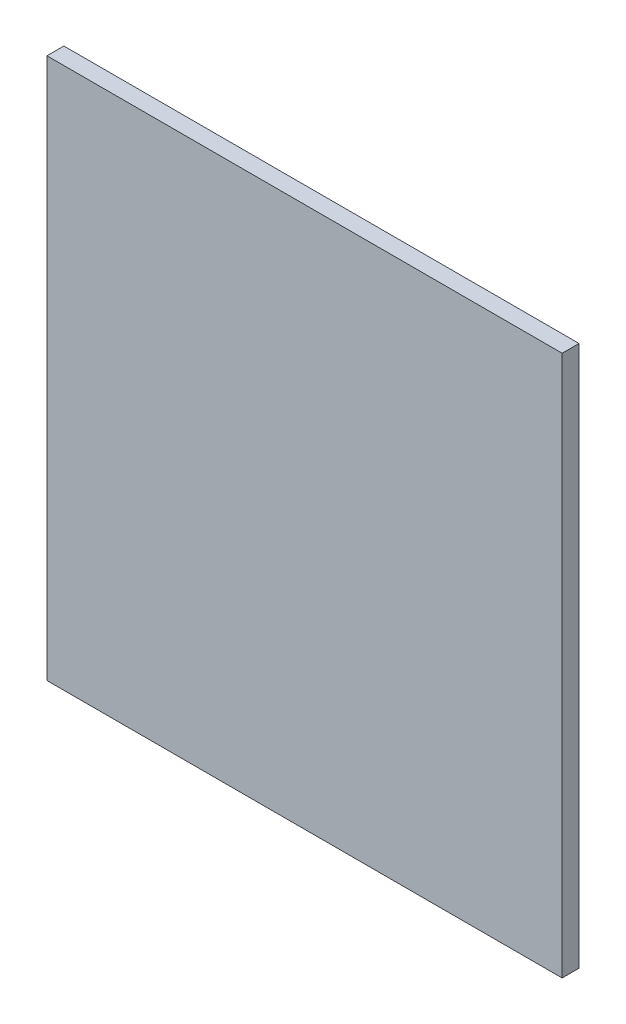
ISO-10303-21;
HEADER;
FILE_DESCRIPTION(('STEP AP214'),'2;1');
FILE_NAME('part.step','',(''),(''),'','','');
FILE_SCHEMA(('AUTOMOTIVE_DESIGN { 1 0 10303 214 1 1 1 1 }'));
ENDSEC;
DATA;
#1=APPLICATION_CONTEXT('core data for automotive mechanical design processes');
#2=APPLICATION_PROTOCOL_DEFINITION('international standard','automotive_design',2000,#1);
#3=PRODUCT_CONTEXT('',#1,'mechanical');
#4=PRODUCT('Part','Part','',(#3));
#5=PRODUCT_RELATED_PRODUCT_CATEGORY('part','',(#4));
#6=PRODUCT_DEFINITION_FORMATION('','',#4);
#7=PRODUCT_DEFINITION_CONTEXT('part definition',#1,'design');
#8=PRODUCT_DEFINITION('design','',#6,#7);
#9=PRODUCT_DEFINITION_SHAPE('','',#8);
#10=(LENGTH_UNIT() NAMED_UNIT(*) SI_UNIT(.MILLI.,.METRE.));
#11=(NAMED_UNIT(*) PLANE_ANGLE_UNIT() SI_UNIT($,.RADIAN.));
#12=(NAMED_UNIT(*) SI_UNIT($,.STERADIAN.) SOLID_ANGLE_UNIT());
#13=UNCERTAINTY_MEASURE_WITH_UNIT(LENGTH_MEASURE(1.E-05),#10,'distance_accuracy_value','');
#14=(GEOMETRIC_REPRESENTATION_CONTEXT(3) GLOBAL_UNCERTAINTY_ASSIGNED_CONTEXT((#13)) GLOBAL_UNIT_ASSIGNED_CONTEXT((#10,
#11,#12)) REPRESENTATION_CONTEXT('',''));
#15=CARTESIAN_POINT('',(0.,0.,0.));
#16=DIRECTION('',(0.,0.,1.));
#17=DIRECTION('',(1.,0.,0.));
#18=AXIS2_PLACEMENT_3D('',#15,#16,#17);
#19=CARTESIAN_POINT('',(0.,0.,6.35));
#20=DIRECTION('',(1.,0.,0.));
#21=DIRECTION('',(0.,0.,-1.));
#22=AXIS2_PLACEMENT_3D('',#19,#20,#21);
#23=PLANE('',#22);
#24=DIRECTION('',(0.,-1.,0.));
#25=VECTOR('',#24,1.);
#26=CARTESIAN_POINT('',(0.,0.,0.));
#27=LINE('',#26,#25);
#28=CARTESIAN_POINT('',(0.,203.2,0.));
#29=VERTEX_POINT('',#28);
#30=CARTESIAN_POINT('',(0.,0.,0.));
#31=VERTEX_POINT('',#30);
#32=EDGE_CURVE('E99',#29,#31,#27,.T.);
#33=ORIENTED_EDGE('',*,*,#32,.T.);
#34=DIRECTION('',(0.,0.,-1.));
#35=VECTOR('',#34,1.);
#36=CARTESIAN_POINT('',(0.,0.,6.35));
#37=LINE('',#36,#35);
#38=CARTESIAN_POINT('',(0.,0.,6.35));
#39=VERTEX_POINT('',#38);
#40=EDGE_CURVE('E11',#39,#31,#37,.T.);
#41=ORIENTED_EDGE('',*,*,#40,.F.);
#42=DIRECTION('',(0.,-1.,0.));
#43=VECTOR('',#42,1.);
#44=CARTESIAN_POINT('',(0.,0.,6.35));
#45=LINE('',#44,#43);
#46=CARTESIAN_POINT('',(0.,203.2,6.35));
#47=VERTEX_POINT('',#46);
#48=EDGE_CURVE('E87',#47,#39,#45,.T.);
#49=ORIENTED_EDGE('',*,*,#48,.F.);
#50=DIRECTION('',(0.,0.,-1.));
#51=VECTOR('',#50,1.);
#52=CARTESIAN_POINT('',(0.,203.2,6.35));
#53=LINE('',#52,#51);
#54=EDGE_CURVE('E95',#47,#29,#53,.T.);
#55=ORIENTED_EDGE('',*,*,#54,.T.);
#56=EDGE_LOOP('',(#33,#41,#49,#55));
#57=FACE_BOUND('',#56,.T.);
#58=ADVANCED_FACE('F36',(#57),#23,.F.);
#59=CARTESIAN_POINT('',(0.,0.,6.35));
#60=DIRECTION('',(0.,1.,0.));
#61=DIRECTION('',(0.,0.,1.));
#62=AXIS2_PLACEMENT_3D('',#59,#60,#61);
#63=PLANE('',#62);
#64=DIRECTION('',(1.,0.,0.));
#65=VECTOR('',#64,1.);
#66=CARTESIAN_POINT('',(0.,0.,0.));
#67=LINE('',#66,#65);
#68=CARTESIAN_POINT('',(193.49,0.,0.));
#69=VERTEX_POINT('',#68);
#70=EDGE_CURVE('E91',#31,#69,#67,.T.);
#71=ORIENTED_EDGE('',*,*,#70,.T.);
#72=DIRECTION('',(0.,0.,-1.));
#73=VECTOR('',#72,1.);
#74=CARTESIAN_POINT('',(193.49,0.,6.35));
#75=LINE('',#74,#73);
#76=CARTESIAN_POINT('',(193.49,0.,6.35));
#77=VERTEX_POINT('',#76);
#78=EDGE_CURVE('E44',#77,#69,#75,.T.);
#79=ORIENTED_EDGE('',*,*,#78,.F.);
#80=DIRECTION('',(1.,0.,0.));
#81=VECTOR('',#80,1.);
#82=CARTESIAN_POINT('',(0.,0.,6.35));
#83=LINE('',#82,#81);
#84=EDGE_CURVE('E82',#39,#77,#83,.T.);
#85=ORIENTED_EDGE('',*,*,#84,.F.);
#86=ORIENTED_EDGE('',*,*,#40,.T.);
#87=EDGE_LOOP('',(#71,#79,#85,#86));
#88=FACE_BOUND('',#87,.T.);
#89=ADVANCED_FACE('F90',(#88),#63,.F.);
#90=CARTESIAN_POINT('',(193.49,0.,6.35));
#91=DIRECTION('',(-1.,0.,0.));
#92=DIRECTION('',(0.,0.,1.));
#93=AXIS2_PLACEMENT_3D('',#90,#91,#92);
#94=PLANE('',#93);
#95=DIRECTION('',(0.,1.,0.));
#96=VECTOR('',#95,1.);
#97=CARTESIAN_POINT('',(193.49,0.,0.));
#98=LINE('',#97,#96);
#99=CARTESIAN_POINT('',(193.49,203.2,0.));
#100=VERTEX_POINT('',#99);
#101=EDGE_CURVE('E69',#69,#100,#98,.T.);
#102=ORIENTED_EDGE('',*,*,#101,.T.);
#103=DIRECTION('',(0.,0.,-1.));
#104=VECTOR('',#103,1.);
#105=CARTESIAN_POINT('',(193.49,203.2,6.35));
#106=LINE('',#105,#104);
#107=CARTESIAN_POINT('',(193.49,203.2,6.35));
#108=VERTEX_POINT('',#107);
#109=EDGE_CURVE('E92',#108,#100,#106,.T.);
#110=ORIENTED_EDGE('',*,*,#109,.F.);
#111=DIRECTION('',(0.,1.,0.));
#112=VECTOR('',#111,1.);
#113=CARTESIAN_POINT('',(193.49,0.,6.35));
#114=LINE('',#113,#112);
#115=EDGE_CURVE('E85',#77,#108,#114,.T.);
#116=ORIENTED_EDGE('',*,*,#115,.F.);
#117=ORIENTED_EDGE('',*,*,#78,.T.);
#118=EDGE_LOOP('',(#102,#110,#116,#117));
#119=FACE_BOUND('',#118,.T.);
#120=ADVANCED_FACE('F93',(#119),#94,.F.);
#121=CARTESIAN_POINT('',(0.,203.2,6.35));
#122=DIRECTION('',(0.,-1.,0.));
#123=DIRECTION('',(0.,0.,-1.));
#124=AXIS2_PLACEMENT_3D('',#121,#122,#123);
#125=PLANE('',#124);
#126=DIRECTION('',(-1.,0.,0.));
#127=VECTOR('',#126,1.);
#128=CARTESIAN_POINT('',(0.,203.2,0.));
#129=LINE('',#128,#127);
#130=EDGE_CURVE('E75',#100,#29,#129,.T.);
#131=ORIENTED_EDGE('',*,*,#130,.T.);
#132=ORIENTED_EDGE('',*,*,#54,.F.);
#133=DIRECTION('',(-1.,0.,0.));
#134=VECTOR('',#133,1.);
#135=CARTESIAN_POINT('',(0.,203.2,6.35));
#136=LINE('',#135,#134);
#137=EDGE_CURVE('E52',#108,#47,#136,.T.);
#138=ORIENTED_EDGE('',*,*,#137,.F.);
#139=ORIENTED_EDGE('',*,*,#109,.T.);
#140=EDGE_LOOP('',(#131,#132,#138,#139));
#141=FACE_BOUND('',#140,.T.);
#142=ADVANCED_FACE('F106',(#141),#125,.F.);
#143=CARTESIAN_POINT('',(0.,0.,6.35));
#144=DIRECTION('',(0.,0.,-1.));
#145=DIRECTION('',(-1.,0.,0.));
#146=AXIS2_PLACEMENT_3D('',#143,#144,#145);
#147=PLANE('',#146);
#148=ORIENTED_EDGE('',*,*,#48,.T.);
#149=ORIENTED_EDGE('',*,*,#84,.T.);
#150=ORIENTED_EDGE('',*,*,#115,.T.);
#151=ORIENTED_EDGE('',*,*,#137,.T.);
#152=EDGE_LOOP('',(#148,#149,#150,#151));
#153=FACE_BOUND('',#152,.T.);
#154=ADVANCED_FACE('F83',(#153),#147,.F.);
#155=CARTESIAN_POINT('',(0.,0.,0.));
#156=DIRECTION('',(0.,0.,-1.));
#157=DIRECTION('',(-1.,0.,0.));
#158=AXIS2_PLACEMENT_3D('',#155,#156,#157);
#159=PLANE('',#158);
#160=ORIENTED_EDGE('',*,*,#32,.F.);
#161=ORIENTED_EDGE('',*,*,#130,.F.);
#162=ORIENTED_EDGE('',*,*,#101,.F.);
#163=ORIENTED_EDGE('',*,*,#70,.F.);
#164=EDGE_LOOP('',(#160,#161,#162,#163));
#165=FACE_BOUND('',#164,.T.);
#166=ADVANCED_FACE('F109',(#165),#159,.T.);
#167=CLOSED_SHELL('',(#58,#89,#120,#142,#154,#166));
#168=MANIFOLD_SOLID_BREP('B2',#167);
#169=ADVANCED_BREP_SHAPE_REPRESENTATION('',(#18,#168),#14);
#170=SHAPE_DEFINITION_REPRESENTATION(#9,#169);
ENDSEC;
END-ISO-10303-21;
